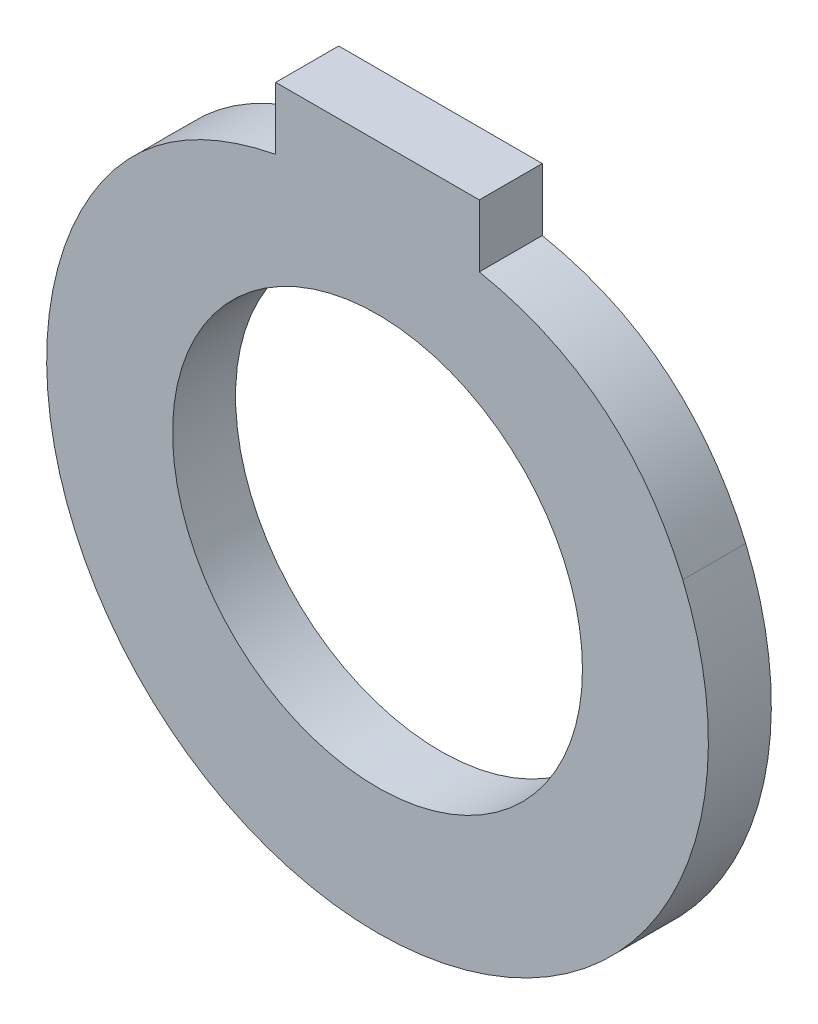
ISO-10303-21;
HEADER;
FILE_DESCRIPTION(('STEP AP214'),'2;1');
FILE_NAME('part.step','',(''),(''),'','','');
FILE_SCHEMA(('AUTOMOTIVE_DESIGN { 1 0 10303 214 1 1 1 1 }'));
ENDSEC;
DATA;
#1=APPLICATION_CONTEXT('core data for automotive mechanical design processes');
#2=APPLICATION_PROTOCOL_DEFINITION('international standard','automotive_design',2000,#1);
#3=PRODUCT_CONTEXT('',#1,'mechanical');
#4=PRODUCT('Part','Part','',(#3));
#5=PRODUCT_RELATED_PRODUCT_CATEGORY('part','',(#4));
#6=PRODUCT_DEFINITION_FORMATION('','',#4);
#7=PRODUCT_DEFINITION_CONTEXT('part definition',#1,'design');
#8=PRODUCT_DEFINITION('design','',#6,#7);
#9=PRODUCT_DEFINITION_SHAPE('','',#8);
#10=(LENGTH_UNIT() NAMED_UNIT(*) SI_UNIT(.MILLI.,.METRE.));
#11=(NAMED_UNIT(*) PLANE_ANGLE_UNIT() SI_UNIT($,.RADIAN.));
#12=(NAMED_UNIT(*) SI_UNIT($,.STERADIAN.) SOLID_ANGLE_UNIT());
#13=UNCERTAINTY_MEASURE_WITH_UNIT(LENGTH_MEASURE(1.E-05),#10,'distance_accuracy_value','');
#14=(GEOMETRIC_REPRESENTATION_CONTEXT(3) GLOBAL_UNCERTAINTY_ASSIGNED_CONTEXT((#13)) GLOBAL_UNIT_ASSIGNED_CONTEXT((#10,
#11,#12)) REPRESENTATION_CONTEXT('',''));
#15=CARTESIAN_POINT('',(0.,0.,0.));
#16=DIRECTION('',(0.,0.,1.));
#17=DIRECTION('',(1.,0.,0.));
#18=AXIS2_PLACEMENT_3D('',#15,#16,#17);
#19=CARTESIAN_POINT('',(22.6993340437834,23.9077160093811,6.35));
#20=DIRECTION('',(0.,0.,-1.));
#21=DIRECTION('',(-1.,0.,0.));
#22=AXIS2_PLACEMENT_3D('',#19,#20,#21);
#23=PLANE('',#22);
#24=CARTESIAN_POINT('',(30.7878177820148,12.8692315925993,6.35));
#25=CARTESIAN_POINT('',(24.8718623827334,26.6306313074961,6.35));
#26=CARTESIAN_POINT('',(10.2657936276519,29.5003698299329,6.35));
#27=B_SPLINE_CURVE_WITH_KNOTS('',2,(#24,#25,#26),.UNSPECIFIED.,.F.,.F.,(3,3),(0.,1.),.UNSPECIFIED.);
#28=CARTESIAN_POINT('',(30.7878177820148,12.8692315925992,6.35));
#29=VERTEX_POINT('',#28);
#30=CARTESIAN_POINT('',(10.2657936276519,29.5003698299329,6.35));
#31=VERTEX_POINT('',#30);
#32=EDGE_CURVE('E169',#29,#31,#27,.T.);
#33=ORIENTED_EDGE('',*,*,#32,.T.);
#34=DIRECTION('',(0.,1.,0.));
#35=VECTOR('',#34,1.);
#36=CARTESIAN_POINT('',(10.2657936276519,35.7911166926517,6.35));
#37=LINE('',#36,#35);
#38=CARTESIAN_POINT('',(10.2657936276519,35.7911166926517,6.35));
#39=VERTEX_POINT('',#38);
#40=EDGE_CURVE('E90',#31,#39,#37,.T.);
#41=ORIENTED_EDGE('',*,*,#40,.T.);
#42=DIRECTION('',(-1.,0.,0.));
#43=VECTOR('',#42,1.);
#44=CARTESIAN_POINT('',(-10.2657936276519,35.7911166926517,6.35));
#45=LINE('',#44,#43);
#46=CARTESIAN_POINT('',(-10.2657936276519,35.7911166926517,6.35));
#47=VERTEX_POINT('',#46);
#48=EDGE_CURVE('E103',#39,#47,#45,.T.);
#49=ORIENTED_EDGE('',*,*,#48,.T.);
#50=DIRECTION('',(0.,-1.,0.));
#51=VECTOR('',#50,1.);
#52=CARTESIAN_POINT('',(-10.2657936276519,35.7911166926517,6.35));
#53=LINE('',#52,#51);
#54=CARTESIAN_POINT('',(-10.2657936276519,29.5003698299329,6.35));
#55=VERTEX_POINT('',#54);
#56=EDGE_CURVE('E97',#47,#55,#53,.T.);
#57=ORIENTED_EDGE('',*,*,#56,.T.);
#58=CARTESIAN_POINT('',(-10.2657936276519,29.5003698299329,6.35));
#59=CARTESIAN_POINT('',(-24.8718623827334,26.6306313074961,6.35));
#60=CARTESIAN_POINT('',(-30.7878177820148,12.8692315925992,6.35));
#61=B_SPLINE_CURVE_WITH_KNOTS('',2,(#58,#59,#60),.UNSPECIFIED.,.F.,.F.,(3,3),(0.,1.),.UNSPECIFIED.);
#62=CARTESIAN_POINT('',(-30.7878177820148,12.8692315925993,6.35));
#63=VERTEX_POINT('',#62);
#64=EDGE_CURVE('E101',#55,#63,#61,.T.);
#65=ORIENTED_EDGE('',*,*,#64,.T.);
#66=CARTESIAN_POINT('',(0.,0.,6.35));
#67=DIRECTION('',(0.,0.,1.));
#68=DIRECTION('',(1.,0.,0.));
#69=AXIS2_PLACEMENT_3D('',#66,#67,#68);
#70=CIRCLE('',#69,33.36925);
#71=EDGE_CURVE('E53',#63,#29,#70,.T.);
#72=ORIENTED_EDGE('',*,*,#71,.T.);
#73=EDGE_LOOP('',(#33,#41,#49,#57,#65,#72));
#74=FACE_BOUND('',#73,.T.);
#75=CARTESIAN_POINT('',(0.,0.,6.35));
#76=DIRECTION('',(0.,0.,1.));
#77=DIRECTION('',(1.,0.,0.));
#78=AXIS2_PLACEMENT_3D('',#75,#76,#77);
#79=CIRCLE('',#78,20.66925);
#80=CARTESIAN_POINT('',(20.66925,0.,6.35));
#81=VERTEX_POINT('',#80);
#82=EDGE_CURVE('E161',#81,#81,#79,.T.);
#83=ORIENTED_EDGE('',*,*,#82,.F.);
#84=EDGE_LOOP('',(#83));
#85=FACE_BOUND('',#84,.T.);
#86=ADVANCED_FACE('F35',(#74,#85),#23,.F.);
#87=CARTESIAN_POINT('',(22.6993340437834,23.9077160093811,0.));
#88=DIRECTION('',(0.,0.,-1.));
#89=DIRECTION('',(-1.,0.,0.));
#90=AXIS2_PLACEMENT_3D('',#87,#88,#89);
#91=PLANE('',#90);
#92=CARTESIAN_POINT('',(30.7878177820148,12.8692315925993,0.));
#93=CARTESIAN_POINT('',(24.8718623827334,26.6306313074961,0.));
#94=CARTESIAN_POINT('',(10.2657936276519,29.5003698299329,0.));
#95=B_SPLINE_CURVE_WITH_KNOTS('',2,(#92,#93,#94),.UNSPECIFIED.,.F.,.F.,(3,3),(0.,1.),.UNSPECIFIED.);
#96=CARTESIAN_POINT('',(30.7878177820148,12.8692315925992,0.));
#97=VERTEX_POINT('',#96);
#98=CARTESIAN_POINT('',(10.2657936276519,29.5003698299329,0.));
#99=VERTEX_POINT('',#98);
#100=EDGE_CURVE('E167',#97,#99,#95,.T.);
#101=ORIENTED_EDGE('',*,*,#100,.F.);
#102=CARTESIAN_POINT('',(0.,0.,0.));
#103=DIRECTION('',(0.,0.,1.));
#104=DIRECTION('',(1.,0.,0.));
#105=AXIS2_PLACEMENT_3D('',#102,#103,#104);
#106=CIRCLE('',#105,33.36925);
#107=CARTESIAN_POINT('',(-30.7878177820148,12.8692315925993,0.));
#108=VERTEX_POINT('',#107);
#109=EDGE_CURVE('E82',#108,#97,#106,.T.);
#110=ORIENTED_EDGE('',*,*,#109,.F.);
#111=CARTESIAN_POINT('',(-10.2657936276519,29.5003698299329,0.));
#112=CARTESIAN_POINT('',(-24.8718623827334,26.6306313074961,0.));
#113=CARTESIAN_POINT('',(-30.7878177820148,12.8692315925992,0.));
#114=B_SPLINE_CURVE_WITH_KNOTS('',2,(#111,#112,#113),.UNSPECIFIED.,.F.,.F.,(3,3),(0.,1.),.UNSPECIFIED.);
#115=CARTESIAN_POINT('',(-10.2657936276519,29.5003698299329,0.));
#116=VERTEX_POINT('',#115);
#117=EDGE_CURVE('E76',#116,#108,#114,.T.);
#118=ORIENTED_EDGE('',*,*,#117,.F.);
#119=DIRECTION('',(0.,-1.,0.));
#120=VECTOR('',#119,1.);
#121=CARTESIAN_POINT('',(-10.2657936276519,35.7911166926517,0.));
#122=LINE('',#121,#120);
#123=CARTESIAN_POINT('',(-10.2657936276519,35.7911166926517,0.));
#124=VERTEX_POINT('',#123);
#125=EDGE_CURVE('E111',#124,#116,#122,.T.);
#126=ORIENTED_EDGE('',*,*,#125,.F.);
#127=DIRECTION('',(-1.,0.,0.));
#128=VECTOR('',#127,1.);
#129=CARTESIAN_POINT('',(-10.2657936276519,35.7911166926517,0.));
#130=LINE('',#129,#128);
#131=CARTESIAN_POINT('',(10.2657936276519,35.7911166926517,0.));
#132=VERTEX_POINT('',#131);
#133=EDGE_CURVE('E182',#132,#124,#130,.T.);
#134=ORIENTED_EDGE('',*,*,#133,.F.);
#135=DIRECTION('',(0.,1.,0.));
#136=VECTOR('',#135,1.);
#137=CARTESIAN_POINT('',(10.2657936276519,35.7911166926517,0.));
#138=LINE('',#137,#136);
#139=EDGE_CURVE('E180',#99,#132,#138,.T.);
#140=ORIENTED_EDGE('',*,*,#139,.F.);
#141=EDGE_LOOP('',(#101,#110,#118,#126,#134,#140));
#142=FACE_BOUND('',#141,.T.);
#143=CARTESIAN_POINT('',(0.,0.,0.));
#144=DIRECTION('',(0.,0.,1.));
#145=DIRECTION('',(1.,0.,0.));
#146=AXIS2_PLACEMENT_3D('',#143,#144,#145);
#147=CIRCLE('',#146,20.66925);
#148=CARTESIAN_POINT('',(20.66925,0.,0.));
#149=VERTEX_POINT('',#148);
#150=EDGE_CURVE('E164',#149,#149,#147,.T.);
#151=ORIENTED_EDGE('',*,*,#150,.T.);
#152=EDGE_LOOP('',(#151));
#153=FACE_BOUND('',#152,.T.);
#154=ADVANCED_FACE('F143',(#142,#153),#91,.T.);
#155=DIRECTION('',(0.,0.,-1.));
#156=VECTOR('',#155,1.);
#157=SURFACE_OF_LINEAR_EXTRUSION('',#27,#156);
#158=ORIENTED_EDGE('',*,*,#100,.T.);
#159=DIRECTION('',(0.,0.,-1.));
#160=VECTOR('',#159,1.);
#161=CARTESIAN_POINT('',(10.2657936276519,29.5003698299329,6.35));
#162=LINE('',#161,#160);
#163=EDGE_CURVE('E11',#31,#99,#162,.T.);
#164=ORIENTED_EDGE('',*,*,#163,.F.);
#165=ORIENTED_EDGE('',*,*,#32,.F.);
#166=DIRECTION('',(0.,0.,-1.));
#167=VECTOR('',#166,1.);
#168=CARTESIAN_POINT('',(30.7878177820148,12.8692315925992,6.35));
#169=LINE('',#168,#167);
#170=EDGE_CURVE('E117',#29,#97,#169,.T.);
#171=ORIENTED_EDGE('',*,*,#170,.T.);
#172=EDGE_LOOP('',(#158,#164,#165,#171));
#173=FACE_BOUND('',#172,.T.);
#174=ADVANCED_FACE('F37',(#173),#157,.F.);
#175=CARTESIAN_POINT('',(10.2657936276519,35.7911166926517,6.35));
#176=DIRECTION('',(-1.,0.,0.));
#177=DIRECTION('',(0.,0.,1.));
#178=AXIS2_PLACEMENT_3D('',#175,#176,#177);
#179=PLANE('',#178);
#180=ORIENTED_EDGE('',*,*,#139,.T.);
#181=DIRECTION('',(0.,0.,-1.));
#182=VECTOR('',#181,1.);
#183=CARTESIAN_POINT('',(10.2657936276519,35.7911166926517,6.35));
#184=LINE('',#183,#182);
#185=EDGE_CURVE('E45',#39,#132,#184,.T.);
#186=ORIENTED_EDGE('',*,*,#185,.F.);
#187=ORIENTED_EDGE('',*,*,#40,.F.);
#188=ORIENTED_EDGE('',*,*,#163,.T.);
#189=EDGE_LOOP('',(#180,#186,#187,#188));
#190=FACE_BOUND('',#189,.T.);
#191=ADVANCED_FACE('F137',(#190),#179,.F.);
#192=CARTESIAN_POINT('',(-10.2657936276519,35.7911166926517,6.35));
#193=DIRECTION('',(0.,-1.,0.));
#194=DIRECTION('',(0.,0.,-1.));
#195=AXIS2_PLACEMENT_3D('',#192,#193,#194);
#196=PLANE('',#195);
#197=ORIENTED_EDGE('',*,*,#133,.T.);
#198=DIRECTION('',(0.,0.,-1.));
#199=VECTOR('',#198,1.);
#200=CARTESIAN_POINT('',(-10.2657936276519,35.7911166926517,6.35));
#201=LINE('',#200,#199);
#202=EDGE_CURVE('E112',#47,#124,#201,.T.);
#203=ORIENTED_EDGE('',*,*,#202,.F.);
#204=ORIENTED_EDGE('',*,*,#48,.F.);
#205=ORIENTED_EDGE('',*,*,#185,.T.);
#206=EDGE_LOOP('',(#197,#203,#204,#205));
#207=FACE_BOUND('',#206,.T.);
#208=ADVANCED_FACE('F135',(#207),#196,.F.);
#209=CARTESIAN_POINT('',(-10.2657936276519,35.7911166926517,6.35));
#210=DIRECTION('',(1.,0.,0.));
#211=DIRECTION('',(0.,0.,-1.));
#212=AXIS2_PLACEMENT_3D('',#209,#210,#211);
#213=PLANE('',#212);
#214=ORIENTED_EDGE('',*,*,#125,.T.);
#215=DIRECTION('',(0.,0.,-1.));
#216=VECTOR('',#215,1.);
#217=CARTESIAN_POINT('',(-10.2657936276519,29.5003698299329,6.35));
#218=LINE('',#217,#216);
#219=EDGE_CURVE('E108',#55,#116,#218,.T.);
#220=ORIENTED_EDGE('',*,*,#219,.F.);
#221=ORIENTED_EDGE('',*,*,#56,.F.);
#222=ORIENTED_EDGE('',*,*,#202,.T.);
#223=EDGE_LOOP('',(#214,#220,#221,#222));
#224=FACE_BOUND('',#223,.T.);
#225=ADVANCED_FACE('F109',(#224),#213,.F.);
#226=DIRECTION('',(0.,0.,-1.));
#227=VECTOR('',#226,1.);
#228=SURFACE_OF_LINEAR_EXTRUSION('',#61,#227);
#229=ORIENTED_EDGE('',*,*,#117,.T.);
#230=DIRECTION('',(0.,0.,-1.));
#231=VECTOR('',#230,1.);
#232=CARTESIAN_POINT('',(-30.7878177820148,12.8692315925993,6.35));
#233=LINE('',#232,#231);
#234=EDGE_CURVE('E113',#63,#108,#233,.T.);
#235=ORIENTED_EDGE('',*,*,#234,.F.);
#236=ORIENTED_EDGE('',*,*,#64,.F.);
#237=ORIENTED_EDGE('',*,*,#219,.T.);
#238=EDGE_LOOP('',(#229,#235,#236,#237));
#239=FACE_BOUND('',#238,.T.);
#240=ADVANCED_FACE('F115',(#239),#228,.F.);
#241=CARTESIAN_POINT('',(0.,0.,6.35));
#242=DIRECTION('',(0.,0.,-1.));
#243=DIRECTION('',(-1.,0.,0.));
#244=AXIS2_PLACEMENT_3D('',#241,#242,#243);
#245=CYLINDRICAL_SURFACE('',#244,33.36925);
#246=ORIENTED_EDGE('',*,*,#109,.T.);
#247=ORIENTED_EDGE('',*,*,#170,.F.);
#248=ORIENTED_EDGE('',*,*,#71,.F.);
#249=ORIENTED_EDGE('',*,*,#234,.T.);
#250=EDGE_LOOP('',(#246,#247,#248,#249));
#251=FACE_BOUND('',#250,.T.);
#252=ADVANCED_FACE('F131',(#251),#245,.T.);
#253=CARTESIAN_POINT('',(0.,0.,6.35));
#254=DIRECTION('',(0.,0.,-1.));
#255=DIRECTION('',(-1.,0.,0.));
#256=AXIS2_PLACEMENT_3D('',#253,#254,#255);
#257=CYLINDRICAL_SURFACE('',#256,20.66925);
#258=ORIENTED_EDGE('',*,*,#82,.T.);
#259=EDGE_LOOP('',(#258));
#260=FACE_BOUND('',#259,.T.);
#261=ORIENTED_EDGE('',*,*,#150,.F.);
#262=EDGE_LOOP('',(#261));
#263=FACE_BOUND('',#262,.T.);
#264=ADVANCED_FACE('F152',(#260,#263),#257,.F.);
#265=CLOSED_SHELL('',(#86,#154,#174,#191,#208,#225,#240,#252,#264));
#266=MANIFOLD_SOLID_BREP('B2',#265);
#267=ADVANCED_BREP_SHAPE_REPRESENTATION('',(#18,#266),#14);
#268=SHAPE_DEFINITION_REPRESENTATION(#9,#267);
ENDSEC;
END-ISO-10303-21;
